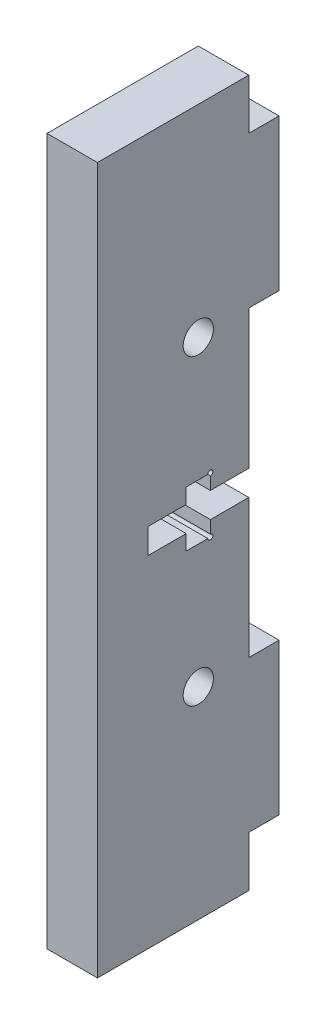
ISO-10303-21;
HEADER;
FILE_DESCRIPTION(('STEP AP214'),'2;1');
FILE_NAME('part.step','',(''),(''),'','','');
FILE_SCHEMA(('AUTOMOTIVE_DESIGN { 1 0 10303 214 1 1 1 1 }'));
ENDSEC;
DATA;
#1=APPLICATION_CONTEXT('core data for automotive mechanical design processes');
#2=APPLICATION_PROTOCOL_DEFINITION('international standard','automotive_design',2000,#1);
#3=PRODUCT_CONTEXT('',#1,'mechanical');
#4=PRODUCT('Part','Part','',(#3));
#5=PRODUCT_RELATED_PRODUCT_CATEGORY('part','',(#4));
#6=PRODUCT_DEFINITION_FORMATION('','',#4);
#7=PRODUCT_DEFINITION_CONTEXT('part definition',#1,'design');
#8=PRODUCT_DEFINITION('design','',#6,#7);
#9=PRODUCT_DEFINITION_SHAPE('','',#8);
#10=(LENGTH_UNIT() NAMED_UNIT(*) SI_UNIT(.MILLI.,.METRE.));
#11=(NAMED_UNIT(*) PLANE_ANGLE_UNIT() SI_UNIT($,.RADIAN.));
#12=(NAMED_UNIT(*) SI_UNIT($,.STERADIAN.) SOLID_ANGLE_UNIT());
#13=UNCERTAINTY_MEASURE_WITH_UNIT(LENGTH_MEASURE(1.E-05),#10,'distance_accuracy_value','');
#14=(GEOMETRIC_REPRESENTATION_CONTEXT(3) GLOBAL_UNCERTAINTY_ASSIGNED_CONTEXT((#13)) GLOBAL_UNIT_ASSIGNED_CONTEXT((#10,
#11,#12)) REPRESENTATION_CONTEXT('',''));
#15=CARTESIAN_POINT('',(0.,0.,0.));
#16=DIRECTION('',(0.,0.,1.));
#17=DIRECTION('',(1.,0.,0.));
#18=AXIS2_PLACEMENT_3D('',#15,#16,#17);
#19=CARTESIAN_POINT('',(5.,35.,-7.49999999999999));
#20=DIRECTION('',(0.,0.,1.));
#21=DIRECTION('',(0.,-1.,0.));
#22=AXIS2_PLACEMENT_3D('',#19,#20,#21);
#23=PLANE('',#22);
#24=DIRECTION('',(-1.,0.,0.));
#25=VECTOR('',#24,1.);
#26=CARTESIAN_POINT('',(5.00005,-1.25,-7.49999999999999));
#27=LINE('',#26,#25);
#28=CARTESIAN_POINT('',(5.,-1.25,-7.49999999999999));
#29=VERTEX_POINT('',#28);
#30=CARTESIAN_POINT('',(0.,-1.25,-7.49999999999999));
#31=VERTEX_POINT('',#30);
#32=EDGE_CURVE('E423',#29,#31,#27,.T.);
#33=ORIENTED_EDGE('',*,*,#32,.F.);
#34=DIRECTION('',(0.,1.,0.));
#35=VECTOR('',#34,1.);
#36=CARTESIAN_POINT('',(5.,35.,-7.49999999999999));
#37=LINE('',#36,#35);
#38=CARTESIAN_POINT('',(5.,-15.,-7.5));
#39=VERTEX_POINT('',#38);
#40=EDGE_CURVE('E330',#39,#29,#37,.T.);
#41=ORIENTED_EDGE('',*,*,#40,.F.);
#42=DIRECTION('',(1.,0.,0.));
#43=VECTOR('',#42,1.);
#44=CARTESIAN_POINT('',(4.99999999999998,-15.,-7.5));
#45=LINE('',#44,#43);
#46=CARTESIAN_POINT('',(0.,-15.,-7.5));
#47=VERTEX_POINT('',#46);
#48=EDGE_CURVE('E257',#47,#39,#45,.T.);
#49=ORIENTED_EDGE('',*,*,#48,.F.);
#50=DIRECTION('',(0.,1.,0.));
#51=VECTOR('',#50,1.);
#52=CARTESIAN_POINT('',(0.,35.,-7.49999999999999));
#53=LINE('',#52,#51);
#54=EDGE_CURVE('E324',#47,#31,#53,.T.);
#55=ORIENTED_EDGE('',*,*,#54,.T.);
#56=EDGE_LOOP('',(#33,#41,#49,#55));
#57=FACE_BOUND('',#56,.T.);
#58=ADVANCED_FACE('F35',(#57),#23,.F.);
#59=DIRECTION('',(-1.,0.,0.));
#60=VECTOR('',#59,1.);
#61=CARTESIAN_POINT('',(5.00005,1.25,-7.49999999999999));
#62=LINE('',#61,#60);
#63=CARTESIAN_POINT('',(5.,1.25,-7.49999999999999));
#64=VERTEX_POINT('',#63);
#65=CARTESIAN_POINT('',(0.,1.25,-7.49999999999999));
#66=VERTEX_POINT('',#65);
#67=EDGE_CURVE('E421',#64,#66,#62,.T.);
#68=ORIENTED_EDGE('',*,*,#67,.T.);
#69=CARTESIAN_POINT('',(0.,15.,-7.5));
#70=VERTEX_POINT('',#69);
#71=EDGE_CURVE('E329',#66,#70,#53,.T.);
#72=ORIENTED_EDGE('',*,*,#71,.T.);
#73=DIRECTION('',(-1.,0.,0.));
#74=VECTOR('',#73,1.);
#75=CARTESIAN_POINT('',(5.00000000000002,15.,-7.5));
#76=LINE('',#75,#74);
#77=CARTESIAN_POINT('',(5.,15.,-7.5));
#78=VERTEX_POINT('',#77);
#79=EDGE_CURVE('E279',#78,#70,#76,.T.);
#80=ORIENTED_EDGE('',*,*,#79,.F.);
#81=EDGE_CURVE('E380',#64,#78,#37,.T.);
#82=ORIENTED_EDGE('',*,*,#81,.F.);
#83=EDGE_LOOP('',(#68,#72,#80,#82));
#84=FACE_BOUND('',#83,.T.);
#85=ADVANCED_FACE('F489',(#84),#23,.F.);
#86=CARTESIAN_POINT('',(5.,0.,0.));
#87=DIRECTION('',(1.,0.,0.));
#88=DIRECTION('',(0.,0.,-1.));
#89=AXIS2_PLACEMENT_3D('',#86,#87,#88);
#90=PLANE('',#89);
#91=CARTESIAN_POINT('',(5.,-2.75,-3.69999999999999));
#92=DIRECTION('',(1.,0.,0.));
#93=DIRECTION('',(0.,0.,-1.));
#94=AXIS2_PLACEMENT_3D('',#91,#92,#93);
#95=CIRCLE('',#94,0.25);
#96=CARTESIAN_POINT('',(5.,-2.75,-3.44999999999999));
#97=VERTEX_POINT('',#96);
#98=CARTESIAN_POINT('',(5.,-2.5,-3.69999999999999));
#99=VERTEX_POINT('',#98);
#100=EDGE_CURVE('E49',#97,#99,#95,.T.);
#101=ORIENTED_EDGE('',*,*,#100,.F.);
#102=DIRECTION('',(0.,0.,1.));
#103=VECTOR('',#102,1.);
#104=CARTESIAN_POINT('',(5.,-2.75,0.));
#105=LINE('',#104,#103);
#106=CARTESIAN_POINT('',(5.,-2.75,-1.29999999999999));
#107=VERTEX_POINT('',#106);
#108=EDGE_CURVE('E219',#97,#107,#105,.T.);
#109=ORIENTED_EDGE('',*,*,#108,.T.);
#110=DIRECTION('',(0.,1.,0.));
#111=VECTOR('',#110,1.);
#112=CARTESIAN_POINT('',(5.,0.,-1.29999999999999));
#113=LINE('',#112,#111);
#114=CARTESIAN_POINT('',(5.,-1.25,-1.29999999999999));
#115=VERTEX_POINT('',#114);
#116=EDGE_CURVE('E227',#107,#115,#113,.T.);
#117=ORIENTED_EDGE('',*,*,#116,.T.);
#118=DIRECTION('',(0.,0.,1.));
#119=VECTOR('',#118,1.);
#120=CARTESIAN_POINT('',(5.,-1.25,0.));
#121=LINE('',#120,#119);
#122=CARTESIAN_POINT('',(5.,-1.25,2.50000000000001));
#123=VERTEX_POINT('',#122);
#124=EDGE_CURVE('E229',#115,#123,#121,.T.);
#125=ORIENTED_EDGE('',*,*,#124,.T.);
#126=DIRECTION('',(0.,1.,0.));
#127=VECTOR('',#126,1.);
#128=CARTESIAN_POINT('',(5.,0.,2.50000000000001));
#129=LINE('',#128,#127);
#130=CARTESIAN_POINT('',(5.,1.25,2.50000000000001));
#131=VERTEX_POINT('',#130);
#132=EDGE_CURVE('E237',#123,#131,#129,.T.);
#133=ORIENTED_EDGE('',*,*,#132,.T.);
#134=DIRECTION('',(0.,0.,-1.));
#135=VECTOR('',#134,1.);
#136=CARTESIAN_POINT('',(5.,1.25,0.));
#137=LINE('',#136,#135);
#138=CARTESIAN_POINT('',(5.,1.25,-1.29999999999999));
#139=VERTEX_POINT('',#138);
#140=EDGE_CURVE('E433',#131,#139,#137,.T.);
#141=ORIENTED_EDGE('',*,*,#140,.T.);
#142=DIRECTION('',(0.,1.,0.));
#143=VECTOR('',#142,1.);
#144=CARTESIAN_POINT('',(5.,0.,-1.29999999999999));
#145=LINE('',#144,#143);
#146=CARTESIAN_POINT('',(5.,2.75,-1.29999999999999));
#147=VERTEX_POINT('',#146);
#148=EDGE_CURVE('E436',#139,#147,#145,.T.);
#149=ORIENTED_EDGE('',*,*,#148,.T.);
#150=DIRECTION('',(0.,0.,-1.));
#151=VECTOR('',#150,1.);
#152=CARTESIAN_POINT('',(5.,2.75,0.));
#153=LINE('',#152,#151);
#154=CARTESIAN_POINT('',(5.,2.75,-3.44999999999999));
#155=VERTEX_POINT('',#154);
#156=EDGE_CURVE('E439',#147,#155,#153,.T.);
#157=ORIENTED_EDGE('',*,*,#156,.T.);
#158=CARTESIAN_POINT('',(5.,2.75,-3.69999999999999));
#159=DIRECTION('',(1.,0.,0.));
#160=DIRECTION('',(0.,0.,-1.));
#161=AXIS2_PLACEMENT_3D('',#158,#159,#160);
#162=CIRCLE('',#161,0.25);
#163=CARTESIAN_POINT('',(5.,2.5,-3.69999999999999));
#164=VERTEX_POINT('',#163);
#165=EDGE_CURVE('E57',#164,#155,#162,.T.);
#166=ORIENTED_EDGE('',*,*,#165,.F.);
#167=DIRECTION('',(0.,-1.,0.));
#168=VECTOR('',#167,1.);
#169=CARTESIAN_POINT('',(5.,0.,-3.69999999999999));
#170=LINE('',#169,#168);
#171=CARTESIAN_POINT('',(5.,1.25,-3.69999999999999));
#172=VERTEX_POINT('',#171);
#173=EDGE_CURVE('E441',#164,#172,#170,.T.);
#174=ORIENTED_EDGE('',*,*,#173,.T.);
#175=DIRECTION('',(0.,0.,-1.));
#176=VECTOR('',#175,1.);
#177=CARTESIAN_POINT('',(5.,1.25,0.));
#178=LINE('',#177,#176);
#179=EDGE_CURVE('E443',#172,#64,#178,.T.);
#180=ORIENTED_EDGE('',*,*,#179,.T.);
#181=ORIENTED_EDGE('',*,*,#81,.T.);
#182=DIRECTION('',(0.,0.,1.));
#183=VECTOR('',#182,1.);
#184=CARTESIAN_POINT('',(5.00000000000002,15.,-10.5));
#185=LINE('',#184,#183);
#186=CARTESIAN_POINT('',(5.00000000000002,15.,-10.5));
#187=VERTEX_POINT('',#186);
#188=EDGE_CURVE('E305',#187,#78,#185,.T.);
#189=ORIENTED_EDGE('',*,*,#188,.F.);
#190=DIRECTION('',(0.,-1.,0.));
#191=VECTOR('',#190,1.);
#192=CARTESIAN_POINT('',(5.00000000000002,30.,-10.5));
#193=LINE('',#192,#191);
#194=CARTESIAN_POINT('',(5.00000000000002,30.,-10.5));
#195=VERTEX_POINT('',#194);
#196=EDGE_CURVE('E280',#195,#187,#193,.T.);
#197=ORIENTED_EDGE('',*,*,#196,.F.);
#198=DIRECTION('',(0.,0.,1.));
#199=VECTOR('',#198,1.);
#200=CARTESIAN_POINT('',(5.00000000000002,30.,-10.5));
#201=LINE('',#200,#199);
#202=CARTESIAN_POINT('',(5.,30.,-7.49999999999999));
#203=VERTEX_POINT('',#202);
#204=EDGE_CURVE('E290',#195,#203,#201,.T.);
#205=ORIENTED_EDGE('',*,*,#204,.T.);
#206=CARTESIAN_POINT('',(5.,35.,-7.49999999999999));
#207=VERTEX_POINT('',#206);
#208=EDGE_CURVE('E299',#203,#207,#37,.T.);
#209=ORIENTED_EDGE('',*,*,#208,.T.);
#210=DIRECTION('',(0.,0.,1.));
#211=VECTOR('',#210,1.);
#212=CARTESIAN_POINT('',(5.,35.,7.50000000000001));
#213=LINE('',#212,#211);
#214=CARTESIAN_POINT('',(5.,35.,7.50000000000001));
#215=VERTEX_POINT('',#214);
#216=EDGE_CURVE('E356',#207,#215,#213,.T.);
#217=ORIENTED_EDGE('',*,*,#216,.T.);
#218=DIRECTION('',(0.,-1.,0.));
#219=VECTOR('',#218,1.);
#220=CARTESIAN_POINT('',(5.,35.,7.50000000000001));
#221=LINE('',#220,#219);
#222=CARTESIAN_POINT('',(5.,-35.,7.5));
#223=VERTEX_POINT('',#222);
#224=EDGE_CURVE('E587',#215,#223,#221,.T.);
#225=ORIENTED_EDGE('',*,*,#224,.T.);
#226=DIRECTION('',(0.,0.,-1.));
#227=VECTOR('',#226,1.);
#228=CARTESIAN_POINT('',(5.,-35.,7.5));
#229=LINE('',#228,#227);
#230=CARTESIAN_POINT('',(5.,-35.,-7.5));
#231=VERTEX_POINT('',#230);
#232=EDGE_CURVE('E588',#223,#231,#229,.T.);
#233=ORIENTED_EDGE('',*,*,#232,.T.);
#234=CARTESIAN_POINT('',(5.,-30.,-7.5));
#235=VERTEX_POINT('',#234);
#236=EDGE_CURVE('E362',#231,#235,#37,.T.);
#237=ORIENTED_EDGE('',*,*,#236,.T.);
#238=DIRECTION('',(0.,0.,1.));
#239=VECTOR('',#238,1.);
#240=CARTESIAN_POINT('',(4.99999999999994,-30.,-10.5));
#241=LINE('',#240,#239);
#242=CARTESIAN_POINT('',(4.99999999999994,-30.,-10.5));
#243=VERTEX_POINT('',#242);
#244=EDGE_CURVE('E263',#243,#235,#241,.T.);
#245=ORIENTED_EDGE('',*,*,#244,.F.);
#246=DIRECTION('',(0.,-1.,0.));
#247=VECTOR('',#246,1.);
#248=CARTESIAN_POINT('',(4.99999999999994,-30.,-10.5));
#249=LINE('',#248,#247);
#250=CARTESIAN_POINT('',(4.99999999999998,-15.,-10.5));
#251=VERTEX_POINT('',#250);
#252=EDGE_CURVE('E261',#251,#243,#249,.T.);
#253=ORIENTED_EDGE('',*,*,#252,.F.);
#254=DIRECTION('',(0.,0.,1.));
#255=VECTOR('',#254,1.);
#256=CARTESIAN_POINT('',(4.99999999999998,-15.,-10.5));
#257=LINE('',#256,#255);
#258=EDGE_CURVE('E270',#251,#39,#257,.T.);
#259=ORIENTED_EDGE('',*,*,#258,.T.);
#260=ORIENTED_EDGE('',*,*,#40,.T.);
#261=DIRECTION('',(0.,0.,1.));
#262=VECTOR('',#261,1.);
#263=CARTESIAN_POINT('',(5.,-1.25,0.));
#264=LINE('',#263,#262);
#265=CARTESIAN_POINT('',(5.,-1.25,-3.69999999999999));
#266=VERTEX_POINT('',#265);
#267=EDGE_CURVE('E231',#29,#266,#264,.T.);
#268=ORIENTED_EDGE('',*,*,#267,.T.);
#269=DIRECTION('',(0.,-1.,0.));
#270=VECTOR('',#269,1.);
#271=CARTESIAN_POINT('',(5.,0.,-3.69999999999999));
#272=LINE('',#271,#270);
#273=EDGE_CURVE('E222',#266,#99,#272,.T.);
#274=ORIENTED_EDGE('',*,*,#273,.T.);
#275=EDGE_LOOP('',(#101,#109,#117,#125,#133,#141,#149,#157,#166,#174,#180,#181,#189,#197,#205,
#209,#217,#225,#233,#237,#245,#253,#259,#260,#268,#274));
#276=FACE_BOUND('',#275,.T.);
#277=CARTESIAN_POINT('',(5.,-15.,-2.5));
#278=DIRECTION('',(1.,0.,0.));
#279=DIRECTION('',(0.,0.,-1.));
#280=AXIS2_PLACEMENT_3D('',#277,#278,#279);
#281=CIRCLE('',#280,1.50000000000001);
#282=CARTESIAN_POINT('',(5.,-15.,-4.00000000000001));
#283=VERTEX_POINT('',#282);
#284=EDGE_CURVE('E243',#283,#283,#281,.F.);
#285=ORIENTED_EDGE('',*,*,#284,.T.);
#286=EDGE_LOOP('',(#285));
#287=FACE_BOUND('',#286,.T.);
#288=CARTESIAN_POINT('',(5.,15.,-2.5));
#289=DIRECTION('',(1.,0.,0.));
#290=DIRECTION('',(0.,0.,-1.));
#291=AXIS2_PLACEMENT_3D('',#288,#289,#290);
#292=CIRCLE('',#291,1.5);
#293=CARTESIAN_POINT('',(5.,15.,-4.));
#294=VERTEX_POINT('',#293);
#295=EDGE_CURVE('E249',#294,#294,#292,.F.);
#296=ORIENTED_EDGE('',*,*,#295,.T.);
#297=EDGE_LOOP('',(#296));
#298=FACE_BOUND('',#297,.T.);
#299=ADVANCED_FACE('F216',(#276,#287,#298),#90,.T.);
#300=CARTESIAN_POINT('',(0.,0.,0.));
#301=DIRECTION('',(1.,0.,0.));
#302=DIRECTION('',(0.,0.,-1.));
#303=AXIS2_PLACEMENT_3D('',#300,#301,#302);
#304=PLANE('',#303);
#305=CARTESIAN_POINT('',(0.,15.,-2.5));
#306=DIRECTION('',(1.,0.,0.));
#307=DIRECTION('',(0.,0.,-1.));
#308=AXIS2_PLACEMENT_3D('',#305,#306,#307);
#309=CIRCLE('',#308,1.5);
#310=CARTESIAN_POINT('',(0.,15.,-4.));
#311=VERTEX_POINT('',#310);
#312=EDGE_CURVE('E246',#311,#311,#309,.T.);
#313=ORIENTED_EDGE('',*,*,#312,.T.);
#314=EDGE_LOOP('',(#313));
#315=FACE_BOUND('',#314,.T.);
#316=CARTESIAN_POINT('',(0.,-15.,-2.5));
#317=DIRECTION('',(1.,0.,0.));
#318=DIRECTION('',(0.,0.,1.));
#319=AXIS2_PLACEMENT_3D('',#316,#317,#318);
#320=CIRCLE('',#319,1.50000000000001);
#321=CARTESIAN_POINT('',(0.,-15.,-0.999999999999994));
#322=VERTEX_POINT('',#321);
#323=EDGE_CURVE('E240',#322,#322,#320,.T.);
#324=ORIENTED_EDGE('',*,*,#323,.T.);
#325=EDGE_LOOP('',(#324));
#326=FACE_BOUND('',#325,.T.);
#327=DIRECTION('',(0.,0.,-1.));
#328=VECTOR('',#327,1.);
#329=CARTESIAN_POINT('',(0.,-2.75,-3.69999999999999));
#330=LINE('',#329,#328);
#331=CARTESIAN_POINT('',(0.,-2.75,-1.29999999999999));
#332=VERTEX_POINT('',#331);
#333=CARTESIAN_POINT('',(0.,-2.75,-3.44999999999999));
#334=VERTEX_POINT('',#333);
#335=EDGE_CURVE('E460',#332,#334,#330,.T.);
#336=ORIENTED_EDGE('',*,*,#335,.T.);
#337=CARTESIAN_POINT('',(0.,-2.75,-3.69999999999999));
#338=DIRECTION('',(1.,0.,0.));
#339=DIRECTION('',(0.,0.,-1.));
#340=AXIS2_PLACEMENT_3D('',#337,#338,#339);
#341=CIRCLE('',#340,0.25);
#342=CARTESIAN_POINT('',(0.,-2.5,-3.69999999999999));
#343=VERTEX_POINT('',#342);
#344=EDGE_CURVE('E208',#334,#343,#341,.T.);
#345=ORIENTED_EDGE('',*,*,#344,.T.);
#346=DIRECTION('',(0.,1.,0.));
#347=VECTOR('',#346,1.);
#348=CARTESIAN_POINT('',(0.,-1.25,-3.69999999999999));
#349=LINE('',#348,#347);
#350=CARTESIAN_POINT('',(0.,-1.25,-3.69999999999999));
#351=VERTEX_POINT('',#350);
#352=EDGE_CURVE('E458',#343,#351,#349,.T.);
#353=ORIENTED_EDGE('',*,*,#352,.T.);
#354=DIRECTION('',(0.,0.,-1.));
#355=VECTOR('',#354,1.);
#356=CARTESIAN_POINT('',(0.,-1.25,-7.49999999999999));
#357=LINE('',#356,#355);
#358=EDGE_CURVE('E456',#351,#31,#357,.T.);
#359=ORIENTED_EDGE('',*,*,#358,.T.);
#360=ORIENTED_EDGE('',*,*,#54,.F.);
#361=DIRECTION('',(0.,0.,1.));
#362=VECTOR('',#361,1.);
#363=CARTESIAN_POINT('',(0.,-15.,-10.5));
#364=LINE('',#363,#362);
#365=CARTESIAN_POINT('',(0.,-15.,-10.5));
#366=VERTEX_POINT('',#365);
#367=EDGE_CURVE('E273',#366,#47,#364,.T.);
#368=ORIENTED_EDGE('',*,*,#367,.F.);
#369=DIRECTION('',(0.,1.,0.));
#370=VECTOR('',#369,1.);
#371=CARTESIAN_POINT('',(0.,-30.,-10.5));
#372=LINE('',#371,#370);
#373=CARTESIAN_POINT('',(0.,-30.,-10.5));
#374=VERTEX_POINT('',#373);
#375=EDGE_CURVE('E256',#374,#366,#372,.T.);
#376=ORIENTED_EDGE('',*,*,#375,.F.);
#377=DIRECTION('',(0.,0.,1.));
#378=VECTOR('',#377,1.);
#379=CARTESIAN_POINT('',(0.,-30.,-10.5));
#380=LINE('',#379,#378);
#381=CARTESIAN_POINT('',(0.,-30.,-7.5));
#382=VERTEX_POINT('',#381);
#383=EDGE_CURVE('E276',#374,#382,#380,.T.);
#384=ORIENTED_EDGE('',*,*,#383,.T.);
#385=CARTESIAN_POINT('',(0.,-35.,-7.5));
#386=VERTEX_POINT('',#385);
#387=EDGE_CURVE('E328',#386,#382,#53,.T.);
#388=ORIENTED_EDGE('',*,*,#387,.F.);
#389=DIRECTION('',(0.,0.,-1.));
#390=VECTOR('',#389,1.);
#391=CARTESIAN_POINT('',(0.,-35.,7.5));
#392=LINE('',#391,#390);
#393=CARTESIAN_POINT('',(0.,-35.,7.5));
#394=VERTEX_POINT('',#393);
#395=EDGE_CURVE('E335',#394,#386,#392,.T.);
#396=ORIENTED_EDGE('',*,*,#395,.F.);
#397=DIRECTION('',(0.,-1.,0.));
#398=VECTOR('',#397,1.);
#399=CARTESIAN_POINT('',(0.,35.,7.50000000000001));
#400=LINE('',#399,#398);
#401=CARTESIAN_POINT('',(0.,35.,7.50000000000001));
#402=VERTEX_POINT('',#401);
#403=EDGE_CURVE('E311',#402,#394,#400,.T.);
#404=ORIENTED_EDGE('',*,*,#403,.F.);
#405=DIRECTION('',(0.,0.,1.));
#406=VECTOR('',#405,1.);
#407=CARTESIAN_POINT('',(0.,35.,7.50000000000001));
#408=LINE('',#407,#406);
#409=CARTESIAN_POINT('',(0.,35.,-7.49999999999999));
#410=VERTEX_POINT('',#409);
#411=EDGE_CURVE('E337',#410,#402,#408,.T.);
#412=ORIENTED_EDGE('',*,*,#411,.F.);
#413=CARTESIAN_POINT('',(0.,30.,-7.49999999999999));
#414=VERTEX_POINT('',#413);
#415=EDGE_CURVE('E342',#414,#410,#53,.T.);
#416=ORIENTED_EDGE('',*,*,#415,.F.);
#417=DIRECTION('',(0.,0.,1.));
#418=VECTOR('',#417,1.);
#419=CARTESIAN_POINT('',(0.,30.,-10.5));
#420=LINE('',#419,#418);
#421=CARTESIAN_POINT('',(0.,30.,-10.5));
#422=VERTEX_POINT('',#421);
#423=EDGE_CURVE('E306',#422,#414,#420,.T.);
#424=ORIENTED_EDGE('',*,*,#423,.F.);
#425=DIRECTION('',(0.,1.,0.));
#426=VECTOR('',#425,1.);
#427=CARTESIAN_POINT('',(0.,30.,-10.5));
#428=LINE('',#427,#426);
#429=CARTESIAN_POINT('',(0.,15.,-10.5));
#430=VERTEX_POINT('',#429);
#431=EDGE_CURVE('E286',#430,#422,#428,.T.);
#432=ORIENTED_EDGE('',*,*,#431,.F.);
#433=DIRECTION('',(0.,0.,1.));
#434=VECTOR('',#433,1.);
#435=CARTESIAN_POINT('',(0.,15.,-10.5));
#436=LINE('',#435,#434);
#437=EDGE_CURVE('E302',#430,#70,#436,.T.);
#438=ORIENTED_EDGE('',*,*,#437,.T.);
#439=ORIENTED_EDGE('',*,*,#71,.F.);
#440=DIRECTION('',(0.,0.,1.));
#441=VECTOR('',#440,1.);
#442=CARTESIAN_POINT('',(0.,1.25,-3.69999999999999));
#443=LINE('',#442,#441);
#444=CARTESIAN_POINT('',(0.,1.25,-3.69999999999999));
#445=VERTEX_POINT('',#444);
#446=EDGE_CURVE('E407',#66,#445,#443,.T.);
#447=ORIENTED_EDGE('',*,*,#446,.T.);
#448=DIRECTION('',(0.,1.,0.));
#449=VECTOR('',#448,1.);
#450=CARTESIAN_POINT('',(0.,2.75,-3.69999999999999));
#451=LINE('',#450,#449);
#452=CARTESIAN_POINT('',(0.,2.5,-3.69999999999999));
#453=VERTEX_POINT('',#452);
#454=EDGE_CURVE('E396',#445,#453,#451,.T.);
#455=ORIENTED_EDGE('',*,*,#454,.T.);
#456=CARTESIAN_POINT('',(0.,2.75,-3.69999999999999));
#457=DIRECTION('',(1.,0.,0.));
#458=DIRECTION('',(0.,0.,-1.));
#459=AXIS2_PLACEMENT_3D('',#456,#457,#458);
#460=CIRCLE('',#459,0.25);
#461=CARTESIAN_POINT('',(0.,2.75,-3.44999999999999));
#462=VERTEX_POINT('',#461);
#463=EDGE_CURVE('E383',#453,#462,#460,.T.);
#464=ORIENTED_EDGE('',*,*,#463,.T.);
#465=DIRECTION('',(0.,0.,1.));
#466=VECTOR('',#465,1.);
#467=CARTESIAN_POINT('',(0.,2.75,-1.29999999999999));
#468=LINE('',#467,#466);
#469=CARTESIAN_POINT('',(0.,2.75,-1.29999999999999));
#470=VERTEX_POINT('',#469);
#471=EDGE_CURVE('E392',#462,#470,#468,.T.);
#472=ORIENTED_EDGE('',*,*,#471,.T.);
#473=DIRECTION('',(0.,-1.,0.));
#474=VECTOR('',#473,1.);
#475=CARTESIAN_POINT('',(0.,1.25,-1.29999999999999));
#476=LINE('',#475,#474);
#477=CARTESIAN_POINT('',(0.,1.25,-1.29999999999999));
#478=VERTEX_POINT('',#477);
#479=EDGE_CURVE('E403',#470,#478,#476,.T.);
#480=ORIENTED_EDGE('',*,*,#479,.T.);
#481=DIRECTION('',(0.,0.,1.));
#482=VECTOR('',#481,1.);
#483=CARTESIAN_POINT('',(0.,1.25,2.50000000000001));
#484=LINE('',#483,#482);
#485=CARTESIAN_POINT('',(0.,1.25,2.50000000000001));
#486=VERTEX_POINT('',#485);
#487=EDGE_CURVE('E405',#478,#486,#484,.T.);
#488=ORIENTED_EDGE('',*,*,#487,.T.);
#489=DIRECTION('',(0.,-1.,0.));
#490=VECTOR('',#489,1.);
#491=CARTESIAN_POINT('',(0.,-1.25,2.50000000000001));
#492=LINE('',#491,#490);
#493=CARTESIAN_POINT('',(0.,-1.25,2.50000000000001));
#494=VERTEX_POINT('',#493);
#495=EDGE_CURVE('E470',#486,#494,#492,.T.);
#496=ORIENTED_EDGE('',*,*,#495,.T.);
#497=DIRECTION('',(0.,0.,-1.));
#498=VECTOR('',#497,1.);
#499=CARTESIAN_POINT('',(0.,-1.25,-1.29999999999999));
#500=LINE('',#499,#498);
#501=CARTESIAN_POINT('',(0.,-1.25,-1.29999999999999));
#502=VERTEX_POINT('',#501);
#503=EDGE_CURVE('E467',#494,#502,#500,.T.);
#504=ORIENTED_EDGE('',*,*,#503,.T.);
#505=DIRECTION('',(0.,-1.,0.));
#506=VECTOR('',#505,1.);
#507=CARTESIAN_POINT('',(0.,-2.75,-1.29999999999999));
#508=LINE('',#507,#506);
#509=EDGE_CURVE('E464',#502,#332,#508,.T.);
#510=ORIENTED_EDGE('',*,*,#509,.T.);
#511=EDGE_LOOP('',(#336,#345,#353,#359,#360,#368,#376,#384,#388,#396,#404,#412,#416,#424,#432,
#438,#439,#447,#455,#464,#472,#480,#488,#496,#504,#510));
#512=FACE_BOUND('',#511,.T.);
#513=ADVANCED_FACE('F390',(#315,#326,#512),#304,.F.);
#514=DIRECTION('',(-1.,0.,0.));
#515=VECTOR('',#514,1.);
#516=CARTESIAN_POINT('',(4.99999999999994,-30.,-7.5));
#517=LINE('',#516,#515);
#518=EDGE_CURVE('E252',#235,#382,#517,.T.);
#519=ORIENTED_EDGE('',*,*,#518,.F.);
#520=ORIENTED_EDGE('',*,*,#236,.F.);
#521=DIRECTION('',(-1.,0.,0.));
#522=VECTOR('',#521,1.);
#523=CARTESIAN_POINT('',(5.,-35.,-7.5));
#524=LINE('',#523,#522);
#525=EDGE_CURVE('E349',#231,#386,#524,.T.);
#526=ORIENTED_EDGE('',*,*,#525,.T.);
#527=ORIENTED_EDGE('',*,*,#387,.T.);
#528=EDGE_LOOP('',(#519,#520,#526,#527));
#529=FACE_BOUND('',#528,.T.);
#530=ADVANCED_FACE('F495',(#529),#23,.F.);
#531=DIRECTION('',(1.,0.,0.));
#532=VECTOR('',#531,1.);
#533=CARTESIAN_POINT('',(5.00000000000002,30.,-7.49999999999999));
#534=LINE('',#533,#532);
#535=EDGE_CURVE('E284',#414,#203,#534,.T.);
#536=ORIENTED_EDGE('',*,*,#535,.F.);
#537=ORIENTED_EDGE('',*,*,#415,.T.);
#538=DIRECTION('',(-1.,0.,0.));
#539=VECTOR('',#538,1.);
#540=CARTESIAN_POINT('',(5.,35.,-7.49999999999999));
#541=LINE('',#540,#539);
#542=EDGE_CURVE('E352',#207,#410,#541,.T.);
#543=ORIENTED_EDGE('',*,*,#542,.F.);
#544=ORIENTED_EDGE('',*,*,#208,.F.);
#545=EDGE_LOOP('',(#536,#537,#543,#544));
#546=FACE_BOUND('',#545,.T.);
#547=ADVANCED_FACE('F491',(#546),#23,.F.);
#548=CARTESIAN_POINT('',(5.,35.,7.50000000000001));
#549=DIRECTION('',(0.,0.,-1.));
#550=DIRECTION('',(0.,1.,0.));
#551=AXIS2_PLACEMENT_3D('',#548,#549,#550);
#552=PLANE('',#551);
#553=ORIENTED_EDGE('',*,*,#403,.T.);
#554=DIRECTION('',(-1.,0.,0.));
#555=VECTOR('',#554,1.);
#556=CARTESIAN_POINT('',(5.,-35.,7.5));
#557=LINE('',#556,#555);
#558=EDGE_CURVE('E346',#223,#394,#557,.T.);
#559=ORIENTED_EDGE('',*,*,#558,.F.);
#560=ORIENTED_EDGE('',*,*,#224,.F.);
#561=DIRECTION('',(-1.,0.,0.));
#562=VECTOR('',#561,1.);
#563=CARTESIAN_POINT('',(5.,35.,7.50000000000001));
#564=LINE('',#563,#562);
#565=EDGE_CURVE('E354',#215,#402,#564,.T.);
#566=ORIENTED_EDGE('',*,*,#565,.T.);
#567=EDGE_LOOP('',(#553,#559,#560,#566));
#568=FACE_BOUND('',#567,.T.);
#569=ADVANCED_FACE('F37',(#568),#552,.F.);
#570=CARTESIAN_POINT('',(5.,-35.,7.5));
#571=DIRECTION('',(0.,1.,0.));
#572=DIRECTION('',(0.,0.,1.));
#573=AXIS2_PLACEMENT_3D('',#570,#571,#572);
#574=PLANE('',#573);
#575=ORIENTED_EDGE('',*,*,#395,.T.);
#576=ORIENTED_EDGE('',*,*,#525,.F.);
#577=ORIENTED_EDGE('',*,*,#232,.F.);
#578=ORIENTED_EDGE('',*,*,#558,.T.);
#579=EDGE_LOOP('',(#575,#576,#577,#578));
#580=FACE_BOUND('',#579,.T.);
#581=ADVANCED_FACE('F502',(#580),#574,.F.);
#582=CARTESIAN_POINT('',(5.,35.,7.50000000000001));
#583=DIRECTION('',(0.,-1.,0.));
#584=DIRECTION('',(0.,0.,-1.));
#585=AXIS2_PLACEMENT_3D('',#582,#583,#584);
#586=PLANE('',#585);
#587=ORIENTED_EDGE('',*,*,#411,.T.);
#588=ORIENTED_EDGE('',*,*,#565,.F.);
#589=ORIENTED_EDGE('',*,*,#216,.F.);
#590=ORIENTED_EDGE('',*,*,#542,.T.);
#591=EDGE_LOOP('',(#587,#588,#589,#590));
#592=FACE_BOUND('',#591,.T.);
#593=ADVANCED_FACE('F577',(#592),#586,.F.);
#594=CARTESIAN_POINT('',(5.00000000000002,15.,-10.5));
#595=DIRECTION('',(0.,1.,0.));
#596=DIRECTION('',(0.,0.,1.));
#597=AXIS2_PLACEMENT_3D('',#594,#595,#596);
#598=PLANE('',#597);
#599=ORIENTED_EDGE('',*,*,#79,.T.);
#600=ORIENTED_EDGE('',*,*,#437,.F.);
#601=DIRECTION('',(-1.,0.,0.));
#602=VECTOR('',#601,1.);
#603=CARTESIAN_POINT('',(5.00000000000002,15.,-10.5));
#604=LINE('',#603,#602);
#605=EDGE_CURVE('E283',#187,#430,#604,.T.);
#606=ORIENTED_EDGE('',*,*,#605,.F.);
#607=ORIENTED_EDGE('',*,*,#188,.T.);
#608=EDGE_LOOP('',(#599,#600,#606,#607));
#609=FACE_BOUND('',#608,.T.);
#610=ADVANCED_FACE('F517',(#609),#598,.F.);
#611=CARTESIAN_POINT('',(5.00000000000002,30.,-10.5));
#612=DIRECTION('',(0.,-1.,0.));
#613=DIRECTION('',(0.,0.,-1.));
#614=AXIS2_PLACEMENT_3D('',#611,#612,#613);
#615=PLANE('',#614);
#616=ORIENTED_EDGE('',*,*,#535,.T.);
#617=ORIENTED_EDGE('',*,*,#204,.F.);
#618=DIRECTION('',(1.,0.,0.));
#619=VECTOR('',#618,1.);
#620=CARTESIAN_POINT('',(5.00000000000002,30.,-10.5));
#621=LINE('',#620,#619);
#622=EDGE_CURVE('E288',#422,#195,#621,.T.);
#623=ORIENTED_EDGE('',*,*,#622,.F.);
#624=ORIENTED_EDGE('',*,*,#423,.T.);
#625=EDGE_LOOP('',(#616,#617,#623,#624));
#626=FACE_BOUND('',#625,.T.);
#627=ADVANCED_FACE('F510',(#626),#615,.F.);
#628=CARTESIAN_POINT('',(0.,0.,-10.5));
#629=DIRECTION('',(0.,0.,-1.));
#630=DIRECTION('',(0.,1.,0.));
#631=AXIS2_PLACEMENT_3D('',#628,#629,#630);
#632=PLANE('',#631);
#633=ORIENTED_EDGE('',*,*,#196,.T.);
#634=ORIENTED_EDGE('',*,*,#605,.T.);
#635=ORIENTED_EDGE('',*,*,#431,.T.);
#636=ORIENTED_EDGE('',*,*,#622,.T.);
#637=EDGE_LOOP('',(#633,#634,#635,#636));
#638=FACE_BOUND('',#637,.T.);
#639=ADVANCED_FACE('F513',(#638),#632,.T.);
#640=CARTESIAN_POINT('',(4.99999999999994,-30.,-10.5));
#641=DIRECTION('',(0.,1.,0.));
#642=DIRECTION('',(-1.,0.,0.));
#643=AXIS2_PLACEMENT_3D('',#640,#641,#642);
#644=PLANE('',#643);
#645=ORIENTED_EDGE('',*,*,#518,.T.);
#646=ORIENTED_EDGE('',*,*,#383,.F.);
#647=DIRECTION('',(-1.,0.,0.));
#648=VECTOR('',#647,1.);
#649=CARTESIAN_POINT('',(4.99999999999994,-30.,-10.5));
#650=LINE('',#649,#648);
#651=EDGE_CURVE('E253',#243,#374,#650,.T.);
#652=ORIENTED_EDGE('',*,*,#651,.F.);
#653=ORIENTED_EDGE('',*,*,#244,.T.);
#654=EDGE_LOOP('',(#645,#646,#652,#653));
#655=FACE_BOUND('',#654,.T.);
#656=ADVANCED_FACE('F566',(#655),#644,.F.);
#657=CARTESIAN_POINT('',(4.99999999999998,-15.,-10.5));
#658=DIRECTION('',(0.,-1.,0.));
#659=DIRECTION('',(1.,0.,0.));
#660=AXIS2_PLACEMENT_3D('',#657,#658,#659);
#661=PLANE('',#660);
#662=ORIENTED_EDGE('',*,*,#48,.T.);
#663=ORIENTED_EDGE('',*,*,#258,.F.);
#664=DIRECTION('',(1.,0.,0.));
#665=VECTOR('',#664,1.);
#666=CARTESIAN_POINT('',(4.99999999999998,-15.,-10.5));
#667=LINE('',#666,#665);
#668=EDGE_CURVE('E259',#366,#251,#667,.T.);
#669=ORIENTED_EDGE('',*,*,#668,.F.);
#670=ORIENTED_EDGE('',*,*,#367,.T.);
#671=EDGE_LOOP('',(#662,#663,#669,#670));
#672=FACE_BOUND('',#671,.T.);
#673=ADVANCED_FACE('F562',(#672),#661,.F.);
#674=CARTESIAN_POINT('',(0.,0.,-10.5));
#675=DIRECTION('',(0.,0.,-1.));
#676=DIRECTION('',(0.,1.,0.));
#677=AXIS2_PLACEMENT_3D('',#674,#675,#676);
#678=PLANE('',#677);
#679=ORIENTED_EDGE('',*,*,#651,.T.);
#680=ORIENTED_EDGE('',*,*,#375,.T.);
#681=ORIENTED_EDGE('',*,*,#668,.T.);
#682=ORIENTED_EDGE('',*,*,#252,.T.);
#683=EDGE_LOOP('',(#679,#680,#681,#682));
#684=FACE_BOUND('',#683,.T.);
#685=ADVANCED_FACE('F558',(#684),#678,.T.);
#686=CARTESIAN_POINT('',(5.00005,15.,-2.5));
#687=DIRECTION('',(-1.,0.,0.));
#688=DIRECTION('',(0.,0.,1.));
#689=AXIS2_PLACEMENT_3D('',#686,#687,#688);
#690=CYLINDRICAL_SURFACE('',#689,1.5);
#691=ORIENTED_EDGE('',*,*,#295,.F.);
#692=EDGE_LOOP('',(#691));
#693=FACE_BOUND('',#692,.T.);
#694=ORIENTED_EDGE('',*,*,#312,.F.);
#695=EDGE_LOOP('',(#694));
#696=FACE_BOUND('',#695,.T.);
#697=ADVANCED_FACE('F554',(#693,#696),#690,.F.);
#698=CARTESIAN_POINT('',(5.00005,-15.,-2.5));
#699=DIRECTION('',(-1.,0.,0.));
#700=DIRECTION('',(0.,0.,1.));
#701=AXIS2_PLACEMENT_3D('',#698,#699,#700);
#702=CYLINDRICAL_SURFACE('',#701,1.50000000000001);
#703=ORIENTED_EDGE('',*,*,#284,.F.);
#704=EDGE_LOOP('',(#703));
#705=FACE_BOUND('',#704,.T.);
#706=ORIENTED_EDGE('',*,*,#323,.F.);
#707=EDGE_LOOP('',(#706));
#708=FACE_BOUND('',#707,.T.);
#709=ADVANCED_FACE('F551',(#705,#708),#702,.F.);
#710=CARTESIAN_POINT('',(5.00005,-1.25,2.50000000000001));
#711=DIRECTION('',(0.,0.,-1.));
#712=DIRECTION('',(-1.,0.,0.));
#713=AXIS2_PLACEMENT_3D('',#710,#711,#712);
#714=PLANE('',#713);
#715=DIRECTION('',(-1.,0.,0.));
#716=VECTOR('',#715,1.);
#717=CARTESIAN_POINT('',(5.00005,-1.25,2.50000000000001));
#718=LINE('',#717,#716);
#719=EDGE_CURVE('E431',#123,#494,#718,.T.);
#720=ORIENTED_EDGE('',*,*,#719,.T.);
#721=ORIENTED_EDGE('',*,*,#495,.F.);
#722=DIRECTION('',(-1.,0.,0.));
#723=VECTOR('',#722,1.);
#724=CARTESIAN_POINT('',(5.00005,1.25,2.50000000000001));
#725=LINE('',#724,#723);
#726=EDGE_CURVE('E413',#131,#486,#725,.T.);
#727=ORIENTED_EDGE('',*,*,#726,.F.);
#728=ORIENTED_EDGE('',*,*,#132,.F.);
#729=EDGE_LOOP('',(#720,#721,#727,#728));
#730=FACE_BOUND('',#729,.T.);
#731=ADVANCED_FACE('F533',(#730),#714,.T.);
#732=CARTESIAN_POINT('',(5.00005,-1.25,-1.29999999999999));
#733=DIRECTION('',(0.,1.,0.));
#734=DIRECTION('',(0.,0.,1.));
#735=AXIS2_PLACEMENT_3D('',#732,#733,#734);
#736=PLANE('',#735);
#737=DIRECTION('',(-1.,0.,0.));
#738=VECTOR('',#737,1.);
#739=CARTESIAN_POINT('',(5.00005,-1.25,-1.29999999999999));
#740=LINE('',#739,#738);
#741=EDGE_CURVE('E429',#115,#502,#740,.T.);
#742=ORIENTED_EDGE('',*,*,#741,.T.);
#743=ORIENTED_EDGE('',*,*,#503,.F.);
#744=ORIENTED_EDGE('',*,*,#719,.F.);
#745=ORIENTED_EDGE('',*,*,#124,.F.);
#746=EDGE_LOOP('',(#742,#743,#744,#745));
#747=FACE_BOUND('',#746,.T.);
#748=ADVANCED_FACE('F537',(#747),#736,.T.);
#749=CARTESIAN_POINT('',(5.00005,-2.75,-1.29999999999999));
#750=DIRECTION('',(0.,0.,-1.));
#751=DIRECTION('',(-1.,0.,0.));
#752=AXIS2_PLACEMENT_3D('',#749,#750,#751);
#753=PLANE('',#752);
#754=DIRECTION('',(-1.,0.,0.));
#755=VECTOR('',#754,1.);
#756=CARTESIAN_POINT('',(5.00005,-2.75,-1.29999999999999));
#757=LINE('',#756,#755);
#758=EDGE_CURVE('E226',#107,#332,#757,.T.);
#759=ORIENTED_EDGE('',*,*,#758,.T.);
#760=ORIENTED_EDGE('',*,*,#509,.F.);
#761=ORIENTED_EDGE('',*,*,#741,.F.);
#762=ORIENTED_EDGE('',*,*,#116,.F.);
#763=EDGE_LOOP('',(#759,#760,#761,#762));
#764=FACE_BOUND('',#763,.T.);
#765=ADVANCED_FACE('F486',(#764),#753,.T.);
#766=CARTESIAN_POINT('',(5.00005,-2.75,-3.69999999999999));
#767=DIRECTION('',(0.,1.,0.));
#768=DIRECTION('',(0.,0.,1.));
#769=AXIS2_PLACEMENT_3D('',#766,#767,#768);
#770=PLANE('',#769);
#771=DIRECTION('',(1.,0.,0.));
#772=VECTOR('',#771,1.);
#773=CARTESIAN_POINT('',(-5.,-2.75,-3.44999999999999));
#774=LINE('',#773,#772);
#775=EDGE_CURVE('E205',#334,#97,#774,.T.);
#776=ORIENTED_EDGE('',*,*,#775,.F.);
#777=ORIENTED_EDGE('',*,*,#335,.F.);
#778=ORIENTED_EDGE('',*,*,#758,.F.);
#779=ORIENTED_EDGE('',*,*,#108,.F.);
#780=EDGE_LOOP('',(#776,#777,#778,#779));
#781=FACE_BOUND('',#780,.T.);
#782=ADVANCED_FACE('F225',(#781),#770,.T.);
#783=CARTESIAN_POINT('',(5.00005,-1.25,-3.69999999999999));
#784=DIRECTION('',(0.,0.,1.));
#785=DIRECTION('',(1.,0.,0.));
#786=AXIS2_PLACEMENT_3D('',#783,#784,#785);
#787=PLANE('',#786);
#788=DIRECTION('',(1.,0.,0.));
#789=VECTOR('',#788,1.);
#790=CARTESIAN_POINT('',(-5.,-2.5,-3.69999999999999));
#791=LINE('',#790,#789);
#792=EDGE_CURVE('E11',#99,#343,#791,.F.);
#793=ORIENTED_EDGE('',*,*,#792,.F.);
#794=ORIENTED_EDGE('',*,*,#273,.F.);
#795=DIRECTION('',(-1.,0.,0.));
#796=VECTOR('',#795,1.);
#797=CARTESIAN_POINT('',(5.00005,-1.25,-3.69999999999999));
#798=LINE('',#797,#796);
#799=EDGE_CURVE('E425',#266,#351,#798,.T.);
#800=ORIENTED_EDGE('',*,*,#799,.T.);
#801=ORIENTED_EDGE('',*,*,#352,.F.);
#802=EDGE_LOOP('',(#793,#794,#800,#801));
#803=FACE_BOUND('',#802,.T.);
#804=ADVANCED_FACE('F476',(#803),#787,.T.);
#805=CARTESIAN_POINT('',(5.00005,-1.25,-7.49999999999999));
#806=DIRECTION('',(0.,1.,0.));
#807=DIRECTION('',(0.,0.,1.));
#808=AXIS2_PLACEMENT_3D('',#805,#806,#807);
#809=PLANE('',#808);
#810=ORIENTED_EDGE('',*,*,#32,.T.);
#811=ORIENTED_EDGE('',*,*,#358,.F.);
#812=ORIENTED_EDGE('',*,*,#799,.F.);
#813=ORIENTED_EDGE('',*,*,#267,.F.);
#814=EDGE_LOOP('',(#810,#811,#812,#813));
#815=FACE_BOUND('',#814,.T.);
#816=ADVANCED_FACE('F449',(#815),#809,.T.);
#817=CARTESIAN_POINT('',(5.00005,1.25,-3.69999999999999));
#818=DIRECTION('',(0.,-1.,0.));
#819=DIRECTION('',(0.,0.,-1.));
#820=AXIS2_PLACEMENT_3D('',#817,#818,#819);
#821=PLANE('',#820);
#822=DIRECTION('',(-1.,0.,0.));
#823=VECTOR('',#822,1.);
#824=CARTESIAN_POINT('',(5.00005,1.25,-3.69999999999999));
#825=LINE('',#824,#823);
#826=EDGE_CURVE('E419',#172,#445,#825,.T.);
#827=ORIENTED_EDGE('',*,*,#826,.T.);
#828=ORIENTED_EDGE('',*,*,#446,.F.);
#829=ORIENTED_EDGE('',*,*,#67,.F.);
#830=ORIENTED_EDGE('',*,*,#179,.F.);
#831=EDGE_LOOP('',(#827,#828,#829,#830));
#832=FACE_BOUND('',#831,.T.);
#833=ADVANCED_FACE('F484',(#832),#821,.T.);
#834=CARTESIAN_POINT('',(5.00005,2.75,-3.69999999999999));
#835=DIRECTION('',(0.,0.,1.));
#836=DIRECTION('',(1.,0.,0.));
#837=AXIS2_PLACEMENT_3D('',#834,#835,#836);
#838=PLANE('',#837);
#839=DIRECTION('',(1.,0.,0.));
#840=VECTOR('',#839,1.);
#841=CARTESIAN_POINT('',(-5.,2.5,-3.69999999999999));
#842=LINE('',#841,#840);
#843=EDGE_CURVE('E397',#453,#164,#842,.T.);
#844=ORIENTED_EDGE('',*,*,#843,.F.);
#845=ORIENTED_EDGE('',*,*,#454,.F.);
#846=ORIENTED_EDGE('',*,*,#826,.F.);
#847=ORIENTED_EDGE('',*,*,#173,.F.);
#848=EDGE_LOOP('',(#844,#845,#846,#847));
#849=FACE_BOUND('',#848,.T.);
#850=ADVANCED_FACE('F524',(#849),#838,.T.);
#851=CARTESIAN_POINT('',(5.00005,2.75,-1.29999999999999));
#852=DIRECTION('',(0.,-1.,0.));
#853=DIRECTION('',(0.,0.,-1.));
#854=AXIS2_PLACEMENT_3D('',#851,#852,#853);
#855=PLANE('',#854);
#856=DIRECTION('',(1.,0.,0.));
#857=VECTOR('',#856,1.);
#858=CARTESIAN_POINT('',(-5.,2.75,-3.44999999999999));
#859=LINE('',#858,#857);
#860=EDGE_CURVE('E43',#155,#462,#859,.F.);
#861=ORIENTED_EDGE('',*,*,#860,.F.);
#862=ORIENTED_EDGE('',*,*,#156,.F.);
#863=DIRECTION('',(-1.,0.,0.));
#864=VECTOR('',#863,1.);
#865=CARTESIAN_POINT('',(5.00005,2.75,-1.29999999999999));
#866=LINE('',#865,#864);
#867=EDGE_CURVE('E401',#147,#470,#866,.T.);
#868=ORIENTED_EDGE('',*,*,#867,.T.);
#869=ORIENTED_EDGE('',*,*,#471,.F.);
#870=EDGE_LOOP('',(#861,#862,#868,#869));
#871=FACE_BOUND('',#870,.T.);
#872=ADVANCED_FACE('F399',(#871),#855,.T.);
#873=CARTESIAN_POINT('',(5.00005,1.25,-1.29999999999999));
#874=DIRECTION('',(0.,0.,-1.));
#875=DIRECTION('',(-1.,0.,0.));
#876=AXIS2_PLACEMENT_3D('',#873,#874,#875);
#877=PLANE('',#876);
#878=DIRECTION('',(-1.,0.,0.));
#879=VECTOR('',#878,1.);
#880=CARTESIAN_POINT('',(5.00005,1.25,-1.29999999999999));
#881=LINE('',#880,#879);
#882=EDGE_CURVE('E416',#139,#478,#881,.T.);
#883=ORIENTED_EDGE('',*,*,#882,.T.);
#884=ORIENTED_EDGE('',*,*,#479,.F.);
#885=ORIENTED_EDGE('',*,*,#867,.F.);
#886=ORIENTED_EDGE('',*,*,#148,.F.);
#887=EDGE_LOOP('',(#883,#884,#885,#886));
#888=FACE_BOUND('',#887,.T.);
#889=ADVANCED_FACE('F526',(#888),#877,.T.);
#890=CARTESIAN_POINT('',(5.00005,1.25,2.50000000000001));
#891=DIRECTION('',(0.,-1.,0.));
#892=DIRECTION('',(0.,0.,-1.));
#893=AXIS2_PLACEMENT_3D('',#890,#891,#892);
#894=PLANE('',#893);
#895=ORIENTED_EDGE('',*,*,#726,.T.);
#896=ORIENTED_EDGE('',*,*,#487,.F.);
#897=ORIENTED_EDGE('',*,*,#882,.F.);
#898=ORIENTED_EDGE('',*,*,#140,.F.);
#899=EDGE_LOOP('',(#895,#896,#897,#898));
#900=FACE_BOUND('',#899,.T.);
#901=ADVANCED_FACE('F530',(#900),#894,.T.);
#902=CARTESIAN_POINT('',(-5.,2.75,-3.69999999999999));
#903=DIRECTION('',(1.,0.,0.));
#904=DIRECTION('',(0.,0.,-1.));
#905=AXIS2_PLACEMENT_3D('',#902,#903,#904);
#906=CYLINDRICAL_SURFACE('',#905,0.25);
#907=ORIENTED_EDGE('',*,*,#843,.T.);
#908=ORIENTED_EDGE('',*,*,#165,.T.);
#909=ORIENTED_EDGE('',*,*,#860,.T.);
#910=ORIENTED_EDGE('',*,*,#463,.F.);
#911=EDGE_LOOP('',(#907,#908,#909,#910));
#912=FACE_BOUND('',#911,.T.);
#913=ADVANCED_FACE('F382',(#912),#906,.F.);
#914=CARTESIAN_POINT('',(-5.,-2.75,-3.69999999999999));
#915=DIRECTION('',(1.,0.,0.));
#916=DIRECTION('',(0.,0.,-1.));
#917=AXIS2_PLACEMENT_3D('',#914,#915,#916);
#918=CYLINDRICAL_SURFACE('',#917,0.25);
#919=ORIENTED_EDGE('',*,*,#775,.T.);
#920=ORIENTED_EDGE('',*,*,#100,.T.);
#921=ORIENTED_EDGE('',*,*,#792,.T.);
#922=ORIENTED_EDGE('',*,*,#344,.F.);
#923=EDGE_LOOP('',(#919,#920,#921,#922));
#924=FACE_BOUND('',#923,.T.);
#925=ADVANCED_FACE('F206',(#924),#918,.F.);
#926=CLOSED_SHELL('',(#58,#85,#299,#513,#530,#547,#569,#581,#593,#610,#627,#639,#656,#673,#685,
#697,#709,#731,#748,#765,#782,#804,#816,#833,#850,#872,#889,#901,#913,#925));
#927=MANIFOLD_SOLID_BREP('B2',#926);
#928=ADVANCED_BREP_SHAPE_REPRESENTATION('',(#18,#927),#14);
#929=SHAPE_DEFINITION_REPRESENTATION(#9,#928);
ENDSEC;
END-ISO-10303-21;
